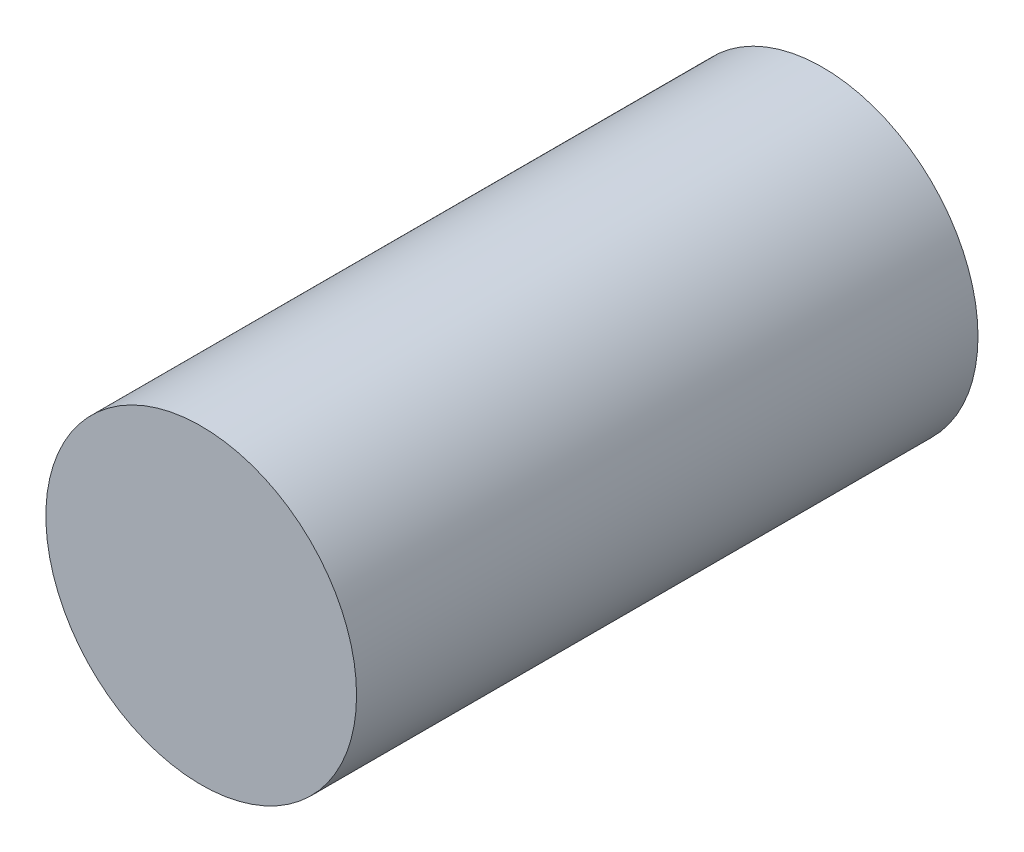
ISO-10303-21;
HEADER;
FILE_DESCRIPTION(('STEP AP214'),'2;1');
FILE_NAME('part.step','',(''),(''),'','','');
FILE_SCHEMA(('AUTOMOTIVE_DESIGN { 1 0 10303 214 1 1 1 1 }'));
ENDSEC;
DATA;
#1=APPLICATION_CONTEXT('core data for automotive mechanical design processes');
#2=APPLICATION_PROTOCOL_DEFINITION('international standard','automotive_design',2000,#1);
#3=PRODUCT_CONTEXT('',#1,'mechanical');
#4=PRODUCT('Part','Part','',(#3));
#5=PRODUCT_RELATED_PRODUCT_CATEGORY('part','',(#4));
#6=PRODUCT_DEFINITION_FORMATION('','',#4);
#7=PRODUCT_DEFINITION_CONTEXT('part definition',#1,'design');
#8=PRODUCT_DEFINITION('design','',#6,#7);
#9=PRODUCT_DEFINITION_SHAPE('','',#8);
#10=(LENGTH_UNIT() NAMED_UNIT(*) SI_UNIT(.MILLI.,.METRE.));
#11=(NAMED_UNIT(*) PLANE_ANGLE_UNIT() SI_UNIT($,.RADIAN.));
#12=(NAMED_UNIT(*) SI_UNIT($,.STERADIAN.) SOLID_ANGLE_UNIT());
#13=UNCERTAINTY_MEASURE_WITH_UNIT(LENGTH_MEASURE(1.E-05),#10,'distance_accuracy_value','');
#14=(GEOMETRIC_REPRESENTATION_CONTEXT(3) GLOBAL_UNCERTAINTY_ASSIGNED_CONTEXT((#13)) GLOBAL_UNIT_ASSIGNED_CONTEXT((#10,
#11,#12)) REPRESENTATION_CONTEXT('',''));
#15=CARTESIAN_POINT('',(0.,0.,0.));
#16=DIRECTION('',(0.,0.,1.));
#17=DIRECTION('',(1.,0.,0.));
#18=AXIS2_PLACEMENT_3D('',#15,#16,#17);
#19=CARTESIAN_POINT('',(0.,0.,2.00000108));
#20=DIRECTION('',(0.,0.,1.));
#21=DIRECTION('',(1.,0.,0.));
#22=AXIS2_PLACEMENT_3D('',#19,#20,#21);
#23=PLANE('',#22);
#24=CARTESIAN_POINT('',(0.,0.,2.00000108));
#25=DIRECTION('',(0.,0.,1.));
#26=DIRECTION('',(1.,0.,0.));
#27=AXIS2_PLACEMENT_3D('',#24,#25,#26);
#28=CIRCLE('',#27,0.499999);
#29=CARTESIAN_POINT('',(0.499999,0.,2.00000108));
#30=VERTEX_POINT('',#29);
#31=EDGE_CURVE('E10',#30,#30,#28,.T.);
#32=ORIENTED_EDGE('',*,*,#31,.T.);
#33=EDGE_LOOP('',(#32));
#34=FACE_BOUND('',#33,.T.);
#35=ADVANCED_FACE('F15',(#34),#23,.T.);
#36=CARTESIAN_POINT('',(0.,0.,0.));
#37=DIRECTION('',(0.,0.,1.));
#38=DIRECTION('',(1.,0.,0.));
#39=AXIS2_PLACEMENT_3D('',#36,#37,#38);
#40=PLANE('',#39);
#41=CARTESIAN_POINT('',(0.,0.,0.));
#42=DIRECTION('',(0.,0.,1.));
#43=DIRECTION('',(1.,0.,0.));
#44=AXIS2_PLACEMENT_3D('',#41,#42,#43);
#45=CIRCLE('',#44,0.499999);
#46=CARTESIAN_POINT('',(0.499999,0.,0.));
#47=VERTEX_POINT('',#46);
#48=EDGE_CURVE('E22',#47,#47,#45,.T.);
#49=ORIENTED_EDGE('',*,*,#48,.F.);
#50=EDGE_LOOP('',(#49));
#51=FACE_BOUND('',#50,.T.);
#52=ADVANCED_FACE('F37',(#51),#40,.F.);
#53=CARTESIAN_POINT('',(0.,0.,0.));
#54=DIRECTION('',(0.,0.,-1.));
#55=DIRECTION('',(1.,0.,0.));
#56=AXIS2_PLACEMENT_3D('',#53,#54,#55);
#57=CYLINDRICAL_SURFACE('',#56,0.499999);
#58=ORIENTED_EDGE('',*,*,#31,.F.);
#59=EDGE_LOOP('',(#58));
#60=FACE_BOUND('',#59,.T.);
#61=ORIENTED_EDGE('',*,*,#48,.T.);
#62=EDGE_LOOP('',(#61));
#63=FACE_BOUND('',#62,.T.);
#64=ADVANCED_FACE('F35',(#60,#63),#57,.T.);
#65=CLOSED_SHELL('',(#35,#52,#64));
#66=MANIFOLD_SOLID_BREP('B1',#65);
#67=ADVANCED_BREP_SHAPE_REPRESENTATION('',(#18,#66),#14);
#68=SHAPE_DEFINITION_REPRESENTATION(#9,#67);
ENDSEC;
END-ISO-10303-21;
